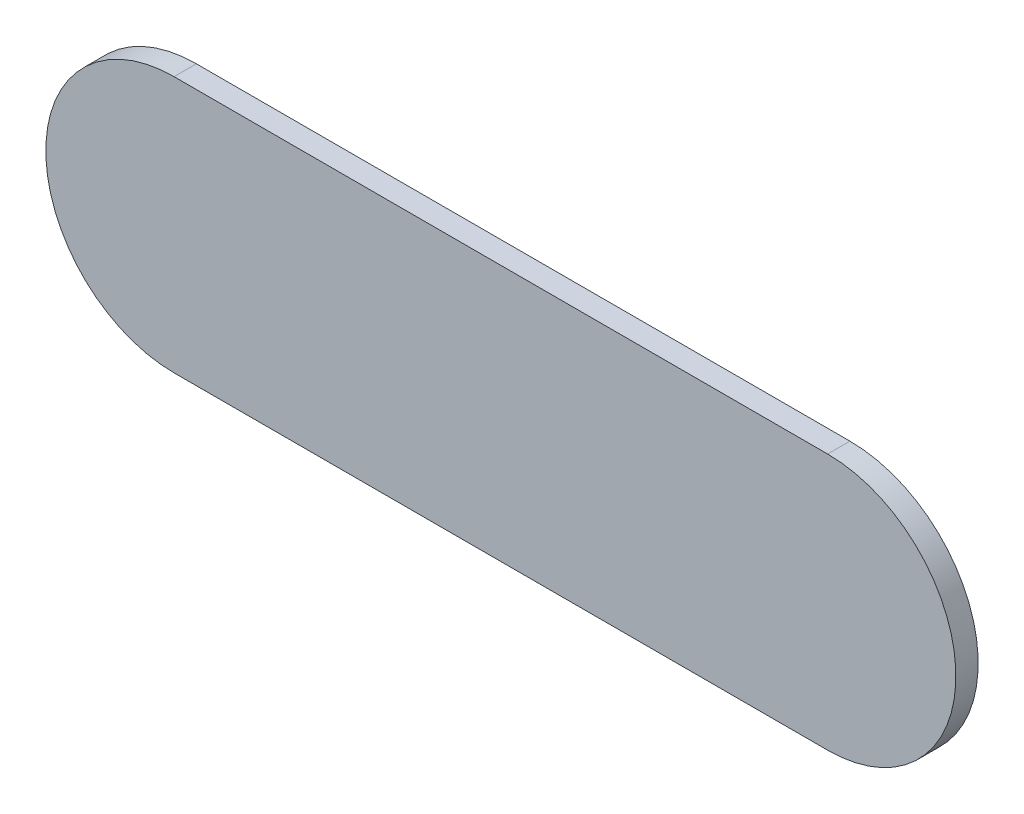
ISO-10303-21;
HEADER;
FILE_DESCRIPTION(('STEP AP214'),'2;1');
FILE_NAME('part.step','',(''),(''),'','','');
FILE_SCHEMA(('AUTOMOTIVE_DESIGN { 1 0 10303 214 1 1 1 1 }'));
ENDSEC;
DATA;
#1=APPLICATION_CONTEXT('core data for automotive mechanical design processes');
#2=APPLICATION_PROTOCOL_DEFINITION('international standard','automotive_design',2000,#1);
#3=PRODUCT_CONTEXT('',#1,'mechanical');
#4=PRODUCT('Part','Part','',(#3));
#5=PRODUCT_RELATED_PRODUCT_CATEGORY('part','',(#4));
#6=PRODUCT_DEFINITION_FORMATION('','',#4);
#7=PRODUCT_DEFINITION_CONTEXT('part definition',#1,'design');
#8=PRODUCT_DEFINITION('design','',#6,#7);
#9=PRODUCT_DEFINITION_SHAPE('','',#8);
#10=(LENGTH_UNIT() NAMED_UNIT(*) SI_UNIT(.MILLI.,.METRE.));
#11=(NAMED_UNIT(*) PLANE_ANGLE_UNIT() SI_UNIT($,.RADIAN.));
#12=(NAMED_UNIT(*) SI_UNIT($,.STERADIAN.) SOLID_ANGLE_UNIT());
#13=UNCERTAINTY_MEASURE_WITH_UNIT(LENGTH_MEASURE(1.E-05),#10,'distance_accuracy_value','');
#14=(GEOMETRIC_REPRESENTATION_CONTEXT(3) GLOBAL_UNCERTAINTY_ASSIGNED_CONTEXT((#13)) GLOBAL_UNIT_ASSIGNED_CONTEXT((#10,
#11,#12)) REPRESENTATION_CONTEXT('',''));
#15=CARTESIAN_POINT('',(0.,0.,0.));
#16=DIRECTION('',(0.,0.,1.));
#17=DIRECTION('',(1.,0.,0.));
#18=AXIS2_PLACEMENT_3D('',#15,#16,#17);
#19=CARTESIAN_POINT('',(14.65,0.,1.));
#20=DIRECTION('',(0.,0.,-1.));
#21=DIRECTION('',(-1.,0.,0.));
#22=AXIS2_PLACEMENT_3D('',#19,#20,#21);
#23=CYLINDRICAL_SURFACE('',#22,5.75);
#24=CARTESIAN_POINT('',(14.65,0.,0.));
#25=DIRECTION('',(0.,0.,1.));
#26=DIRECTION('',(-1.,0.,0.));
#27=AXIS2_PLACEMENT_3D('',#24,#25,#26);
#28=CIRCLE('',#27,5.75);
#29=CARTESIAN_POINT('',(14.65,-5.75,0.));
#30=VERTEX_POINT('',#29);
#31=CARTESIAN_POINT('',(14.65,5.75,0.));
#32=VERTEX_POINT('',#31);
#33=EDGE_CURVE('E95',#30,#32,#28,.T.);
#34=ORIENTED_EDGE('',*,*,#33,.T.);
#35=DIRECTION('',(0.,0.,-1.));
#36=VECTOR('',#35,1.);
#37=CARTESIAN_POINT('',(14.65,5.75,1.));
#38=LINE('',#37,#36);
#39=CARTESIAN_POINT('',(14.65,5.75,1.));
#40=VERTEX_POINT('',#39);
#41=EDGE_CURVE('E11',#40,#32,#38,.T.);
#42=ORIENTED_EDGE('',*,*,#41,.F.);
#43=CARTESIAN_POINT('',(14.65,0.,1.));
#44=DIRECTION('',(0.,0.,1.));
#45=DIRECTION('',(-1.,0.,0.));
#46=AXIS2_PLACEMENT_3D('',#43,#44,#45);
#47=CIRCLE('',#46,5.75);
#48=CARTESIAN_POINT('',(14.65,-5.75,1.));
#49=VERTEX_POINT('',#48);
#50=EDGE_CURVE('E83',#49,#40,#47,.T.);
#51=ORIENTED_EDGE('',*,*,#50,.F.);
#52=DIRECTION('',(0.,0.,-1.));
#53=VECTOR('',#52,1.);
#54=CARTESIAN_POINT('',(14.65,-5.75,1.));
#55=LINE('',#54,#53);
#56=EDGE_CURVE('E91',#49,#30,#55,.T.);
#57=ORIENTED_EDGE('',*,*,#56,.T.);
#58=EDGE_LOOP('',(#34,#42,#51,#57));
#59=FACE_BOUND('',#58,.T.);
#60=ADVANCED_FACE('F32',(#59),#23,.T.);
#61=CARTESIAN_POINT('',(-14.65,5.75,1.));
#62=DIRECTION('',(0.,-1.,0.));
#63=DIRECTION('',(0.,0.,-1.));
#64=AXIS2_PLACEMENT_3D('',#61,#62,#63);
#65=PLANE('',#64);
#66=DIRECTION('',(-1.,0.,0.));
#67=VECTOR('',#66,1.);
#68=CARTESIAN_POINT('',(-14.65,5.75,0.));
#69=LINE('',#68,#67);
#70=CARTESIAN_POINT('',(-14.65,5.75,0.));
#71=VERTEX_POINT('',#70);
#72=EDGE_CURVE('E87',#32,#71,#69,.T.);
#73=ORIENTED_EDGE('',*,*,#72,.T.);
#74=DIRECTION('',(0.,0.,-1.));
#75=VECTOR('',#74,1.);
#76=CARTESIAN_POINT('',(-14.65,5.75,1.));
#77=LINE('',#76,#75);
#78=CARTESIAN_POINT('',(-14.65,5.75,1.));
#79=VERTEX_POINT('',#78);
#80=EDGE_CURVE('E40',#79,#71,#77,.T.);
#81=ORIENTED_EDGE('',*,*,#80,.F.);
#82=DIRECTION('',(-1.,0.,0.));
#83=VECTOR('',#82,1.);
#84=CARTESIAN_POINT('',(-14.65,5.75,1.));
#85=LINE('',#84,#83);
#86=EDGE_CURVE('E78',#40,#79,#85,.T.);
#87=ORIENTED_EDGE('',*,*,#86,.F.);
#88=ORIENTED_EDGE('',*,*,#41,.T.);
#89=EDGE_LOOP('',(#73,#81,#87,#88));
#90=FACE_BOUND('',#89,.T.);
#91=ADVANCED_FACE('F86',(#90),#65,.F.);
#92=CARTESIAN_POINT('',(-14.65,0.,1.));
#93=DIRECTION('',(0.,0.,-1.));
#94=DIRECTION('',(-1.,0.,0.));
#95=AXIS2_PLACEMENT_3D('',#92,#93,#94);
#96=CYLINDRICAL_SURFACE('',#95,5.75);
#97=CARTESIAN_POINT('',(-14.65,0.,0.));
#98=DIRECTION('',(0.,0.,1.));
#99=DIRECTION('',(-1.,0.,0.));
#100=AXIS2_PLACEMENT_3D('',#97,#98,#99);
#101=CIRCLE('',#100,5.75);
#102=CARTESIAN_POINT('',(-14.65,-5.75,0.));
#103=VERTEX_POINT('',#102);
#104=EDGE_CURVE('E65',#71,#103,#101,.T.);
#105=ORIENTED_EDGE('',*,*,#104,.T.);
#106=DIRECTION('',(0.,0.,-1.));
#107=VECTOR('',#106,1.);
#108=CARTESIAN_POINT('',(-14.65,-5.75,1.));
#109=LINE('',#108,#107);
#110=CARTESIAN_POINT('',(-14.65,-5.75,1.));
#111=VERTEX_POINT('',#110);
#112=EDGE_CURVE('E88',#111,#103,#109,.T.);
#113=ORIENTED_EDGE('',*,*,#112,.F.);
#114=CARTESIAN_POINT('',(-14.65,0.,1.));
#115=DIRECTION('',(0.,0.,1.));
#116=DIRECTION('',(-1.,0.,0.));
#117=AXIS2_PLACEMENT_3D('',#114,#115,#116);
#118=CIRCLE('',#117,5.75);
#119=EDGE_CURVE('E81',#79,#111,#118,.T.);
#120=ORIENTED_EDGE('',*,*,#119,.F.);
#121=ORIENTED_EDGE('',*,*,#80,.T.);
#122=EDGE_LOOP('',(#105,#113,#120,#121));
#123=FACE_BOUND('',#122,.T.);
#124=ADVANCED_FACE('F89',(#123),#96,.T.);
#125=CARTESIAN_POINT('',(-14.65,-5.75,1.));
#126=DIRECTION('',(0.,1.,0.));
#127=DIRECTION('',(-1.,0.,0.));
#128=AXIS2_PLACEMENT_3D('',#125,#126,#127);
#129=PLANE('',#128);
#130=DIRECTION('',(1.,0.,0.));
#131=VECTOR('',#130,1.);
#132=CARTESIAN_POINT('',(-14.65,-5.75,0.));
#133=LINE('',#132,#131);
#134=EDGE_CURVE('E71',#103,#30,#133,.T.);
#135=ORIENTED_EDGE('',*,*,#134,.T.);
#136=ORIENTED_EDGE('',*,*,#56,.F.);
#137=DIRECTION('',(1.,0.,0.));
#138=VECTOR('',#137,1.);
#139=CARTESIAN_POINT('',(-14.65,-5.75,1.));
#140=LINE('',#139,#138);
#141=EDGE_CURVE('E48',#111,#49,#140,.T.);
#142=ORIENTED_EDGE('',*,*,#141,.F.);
#143=ORIENTED_EDGE('',*,*,#112,.T.);
#144=EDGE_LOOP('',(#135,#136,#142,#143));
#145=FACE_BOUND('',#144,.T.);
#146=ADVANCED_FACE('F102',(#145),#129,.F.);
#147=CARTESIAN_POINT('',(14.65,0.,1.));
#148=DIRECTION('',(0.,0.,-1.));
#149=DIRECTION('',(-1.,0.,0.));
#150=AXIS2_PLACEMENT_3D('',#147,#148,#149);
#151=PLANE('',#150);
#152=ORIENTED_EDGE('',*,*,#50,.T.);
#153=ORIENTED_EDGE('',*,*,#86,.T.);
#154=ORIENTED_EDGE('',*,*,#119,.T.);
#155=ORIENTED_EDGE('',*,*,#141,.T.);
#156=EDGE_LOOP('',(#152,#153,#154,#155));
#157=FACE_BOUND('',#156,.T.);
#158=ADVANCED_FACE('F79',(#157),#151,.F.);
#159=CARTESIAN_POINT('',(14.65,0.,0.));
#160=DIRECTION('',(0.,0.,-1.));
#161=DIRECTION('',(-1.,0.,0.));
#162=AXIS2_PLACEMENT_3D('',#159,#160,#161);
#163=PLANE('',#162);
#164=ORIENTED_EDGE('',*,*,#33,.F.);
#165=ORIENTED_EDGE('',*,*,#134,.F.);
#166=ORIENTED_EDGE('',*,*,#104,.F.);
#167=ORIENTED_EDGE('',*,*,#72,.F.);
#168=EDGE_LOOP('',(#164,#165,#166,#167));
#169=FACE_BOUND('',#168,.T.);
#170=ADVANCED_FACE('F105',(#169),#163,.T.);
#171=CLOSED_SHELL('',(#60,#91,#124,#146,#158,#170));
#172=MANIFOLD_SOLID_BREP('B2',#171);
#173=ADVANCED_BREP_SHAPE_REPRESENTATION('',(#18,#172),#14);
#174=SHAPE_DEFINITION_REPRESENTATION(#9,#173);
ENDSEC;
END-ISO-10303-21;
